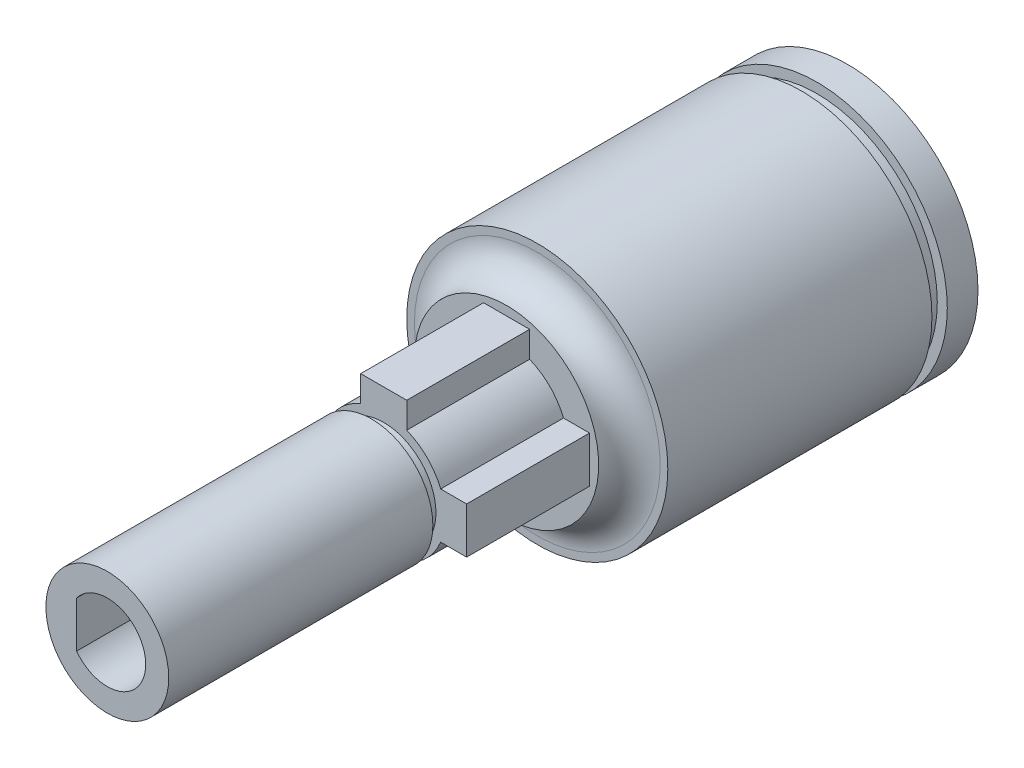
ISO-10303-21;
HEADER;
FILE_DESCRIPTION(('STEP AP214'),'2;1');
FILE_NAME('part.step','',(''),(''),'','','');
FILE_SCHEMA(('AUTOMOTIVE_DESIGN { 1 0 10303 214 1 1 1 1 }'));
ENDSEC;
DATA;
#1=APPLICATION_CONTEXT('core data for automotive mechanical design processes');
#2=APPLICATION_PROTOCOL_DEFINITION('international standard','automotive_design',2000,#1);
#3=PRODUCT_CONTEXT('',#1,'mechanical');
#4=PRODUCT('Part','Part','',(#3));
#5=PRODUCT_RELATED_PRODUCT_CATEGORY('part','',(#4));
#6=PRODUCT_DEFINITION_FORMATION('','',#4);
#7=PRODUCT_DEFINITION_CONTEXT('part definition',#1,'design');
#8=PRODUCT_DEFINITION('design','',#6,#7);
#9=PRODUCT_DEFINITION_SHAPE('','',#8);
#10=(LENGTH_UNIT() NAMED_UNIT(*) SI_UNIT(.MILLI.,.METRE.));
#11=(NAMED_UNIT(*) PLANE_ANGLE_UNIT() SI_UNIT($,.RADIAN.));
#12=(NAMED_UNIT(*) SI_UNIT($,.STERADIAN.) SOLID_ANGLE_UNIT());
#13=UNCERTAINTY_MEASURE_WITH_UNIT(LENGTH_MEASURE(1.E-05),#10,'distance_accuracy_value','');
#14=(GEOMETRIC_REPRESENTATION_CONTEXT(3) GLOBAL_UNCERTAINTY_ASSIGNED_CONTEXT((#13)) GLOBAL_UNIT_ASSIGNED_CONTEXT((#10,
#11,#12)) REPRESENTATION_CONTEXT('',''));
#15=CARTESIAN_POINT('',(0.,0.,0.));
#16=DIRECTION('',(0.,0.,1.));
#17=DIRECTION('',(1.,0.,0.));
#18=AXIS2_PLACEMENT_3D('',#15,#16,#17);
#19=CARTESIAN_POINT('',(0.,0.,-23.2));
#20=DIRECTION('',(0.,0.,1.));
#21=DIRECTION('',(1.,0.,0.));
#22=AXIS2_PLACEMENT_3D('',#19,#20,#21);
#23=CYLINDRICAL_SURFACE('',#22,8.5);
#24=CARTESIAN_POINT('',(0.,0.,-3.));
#25=DIRECTION('',(0.,0.,-1.));
#26=DIRECTION('',(-1.,0.,0.));
#27=AXIS2_PLACEMENT_3D('',#24,#25,#26);
#28=CIRCLE('',#27,8.5);
#29=CARTESIAN_POINT('',(-8.5,0.,-3.));
#30=VERTEX_POINT('',#29);
#31=EDGE_CURVE('E248',#30,#30,#28,.T.);
#32=ORIENTED_EDGE('',*,*,#31,.T.);
#33=EDGE_LOOP('',(#32));
#34=FACE_BOUND('',#33,.T.);
#35=CARTESIAN_POINT('',(0.,0.,-20.2));
#36=DIRECTION('',(0.,0.,1.));
#37=DIRECTION('',(1.,0.,0.));
#38=AXIS2_PLACEMENT_3D('',#35,#36,#37);
#39=CIRCLE('',#38,8.5);
#40=CARTESIAN_POINT('',(8.5,0.,-20.2));
#41=VERTEX_POINT('',#40);
#42=EDGE_CURVE('E237',#41,#41,#39,.T.);
#43=ORIENTED_EDGE('',*,*,#42,.T.);
#44=EDGE_LOOP('',(#43));
#45=FACE_BOUND('',#44,.T.);
#46=ADVANCED_FACE('F36',(#34,#45),#23,.T.);
#47=CARTESIAN_POINT('',(0.,0.,-1.));
#48=DIRECTION('',(0.,0.,1.));
#49=DIRECTION('',(1.,0.,0.));
#50=AXIS2_PLACEMENT_3D('',#47,#48,#49);
#51=CYLINDRICAL_SURFACE('',#50,4.);
#52=DIRECTION('',(0.,0.,1.));
#53=VECTOR('',#52,1.);
#54=CARTESIAN_POINT('',(1.5,3.70809924354783,-1.));
#55=LINE('',#54,#53);
#56=CARTESIAN_POINT('',(1.5,3.70809924354783,-1.));
#57=VERTEX_POINT('',#56);
#58=CARTESIAN_POINT('',(1.5,3.70809924354783,7.));
#59=VERTEX_POINT('',#58);
#60=EDGE_CURVE('E135',#57,#59,#55,.T.);
#61=ORIENTED_EDGE('',*,*,#60,.T.);
#62=CARTESIAN_POINT('',(0.,0.,7.));
#63=DIRECTION('',(0.,0.,-1.));
#64=DIRECTION('',(-1.,0.,0.));
#65=AXIS2_PLACEMENT_3D('',#62,#63,#64);
#66=CIRCLE('',#65,4.);
#67=CARTESIAN_POINT('',(3.70809924354784,1.49999999999999,7.));
#68=VERTEX_POINT('',#67);
#69=EDGE_CURVE('E125',#59,#68,#66,.T.);
#70=ORIENTED_EDGE('',*,*,#69,.T.);
#71=DIRECTION('',(0.,0.,1.));
#72=VECTOR('',#71,1.);
#73=CARTESIAN_POINT('',(3.70809924354784,1.49999999999999,-1.));
#74=LINE('',#73,#72);
#75=CARTESIAN_POINT('',(3.70809924354784,1.49999999999999,-1.));
#76=VERTEX_POINT('',#75);
#77=EDGE_CURVE('E151',#76,#68,#74,.T.);
#78=ORIENTED_EDGE('',*,*,#77,.F.);
#79=CARTESIAN_POINT('',(0.,0.,-1.));
#80=DIRECTION('',(0.,0.,1.));
#81=DIRECTION('',(1.,0.,0.));
#82=AXIS2_PLACEMENT_3D('',#79,#80,#81);
#83=CIRCLE('',#82,4.);
#84=EDGE_CURVE('E176',#57,#76,#83,.F.);
#85=ORIENTED_EDGE('',*,*,#84,.F.);
#86=EDGE_LOOP('',(#61,#70,#78,#85));
#87=FACE_BOUND('',#86,.T.);
#88=ADVANCED_FACE('F197',(#87),#51,.T.);
#89=DIRECTION('',(0.,0.,1.));
#90=VECTOR('',#89,1.);
#91=CARTESIAN_POINT('',(3.70809924354783,-1.50000000000001,-1.));
#92=LINE('',#91,#90);
#93=CARTESIAN_POINT('',(3.70809924354783,-1.50000000000001,-1.));
#94=VERTEX_POINT('',#93);
#95=CARTESIAN_POINT('',(3.70809924354783,-1.50000000000001,7.));
#96=VERTEX_POINT('',#95);
#97=EDGE_CURVE('E120',#94,#96,#92,.T.);
#98=ORIENTED_EDGE('',*,*,#97,.T.);
#99=CARTESIAN_POINT('',(-1.5,3.70809924354783,7.));
#100=VERTEX_POINT('',#99);
#101=EDGE_CURVE('E114',#96,#100,#66,.T.);
#102=ORIENTED_EDGE('',*,*,#101,.T.);
#103=DIRECTION('',(0.,0.,1.));
#104=VECTOR('',#103,1.);
#105=CARTESIAN_POINT('',(-1.5,3.70809924354783,-1.));
#106=LINE('',#105,#104);
#107=CARTESIAN_POINT('',(-1.5,3.70809924354783,-1.));
#108=VERTEX_POINT('',#107);
#109=EDGE_CURVE('E118',#108,#100,#106,.T.);
#110=ORIENTED_EDGE('',*,*,#109,.F.);
#111=EDGE_CURVE('E175',#94,#108,#83,.F.);
#112=ORIENTED_EDGE('',*,*,#111,.F.);
#113=EDGE_LOOP('',(#98,#102,#110,#112));
#114=FACE_BOUND('',#113,.T.);
#115=ADVANCED_FACE('F116',(#114),#51,.T.);
#116=CARTESIAN_POINT('',(-1.5,0.,-1.));
#117=DIRECTION('',(-1.,0.,0.));
#118=DIRECTION('',(0.,0.,1.));
#119=AXIS2_PLACEMENT_3D('',#116,#117,#118);
#120=PLANE('',#119);
#121=ORIENTED_EDGE('',*,*,#109,.T.);
#122=DIRECTION('',(0.,-1.,0.));
#123=VECTOR('',#122,1.);
#124=CARTESIAN_POINT('',(-1.5,0.,7.));
#125=LINE('',#124,#123);
#126=CARTESIAN_POINT('',(-1.5,5.4,7.));
#127=VERTEX_POINT('',#126);
#128=EDGE_CURVE('E133',#127,#100,#125,.T.);
#129=ORIENTED_EDGE('',*,*,#128,.F.);
#130=DIRECTION('',(0.,0.,1.));
#131=VECTOR('',#130,1.);
#132=CARTESIAN_POINT('',(-1.5,5.4,-1.));
#133=LINE('',#132,#131);
#134=CARTESIAN_POINT('',(-1.5,5.4,-1.));
#135=VERTEX_POINT('',#134);
#136=EDGE_CURVE('E161',#135,#127,#133,.T.);
#137=ORIENTED_EDGE('',*,*,#136,.F.);
#138=DIRECTION('',(0.,-1.,0.));
#139=VECTOR('',#138,1.);
#140=CARTESIAN_POINT('',(-1.5,0.,-1.));
#141=LINE('',#140,#139);
#142=EDGE_CURVE('E134',#135,#108,#141,.T.);
#143=ORIENTED_EDGE('',*,*,#142,.T.);
#144=EDGE_LOOP('',(#121,#129,#137,#143));
#145=FACE_BOUND('',#144,.T.);
#146=ADVANCED_FACE('F131',(#145),#120,.T.);
#147=CARTESIAN_POINT('',(0.,5.4,-1.));
#148=DIRECTION('',(0.,1.,0.));
#149=DIRECTION('',(0.,0.,1.));
#150=AXIS2_PLACEMENT_3D('',#147,#148,#149);
#151=PLANE('',#150);
#152=ORIENTED_EDGE('',*,*,#136,.T.);
#153=DIRECTION('',(-1.,0.,0.));
#154=VECTOR('',#153,1.);
#155=CARTESIAN_POINT('',(0.,5.4,7.));
#156=LINE('',#155,#154);
#157=CARTESIAN_POINT('',(1.5,5.4,7.));
#158=VERTEX_POINT('',#157);
#159=EDGE_CURVE('E143',#158,#127,#156,.T.);
#160=ORIENTED_EDGE('',*,*,#159,.F.);
#161=DIRECTION('',(0.,0.,1.));
#162=VECTOR('',#161,1.);
#163=CARTESIAN_POINT('',(1.5,5.4,-1.));
#164=LINE('',#163,#162);
#165=CARTESIAN_POINT('',(1.5,5.4,-1.));
#166=VERTEX_POINT('',#165);
#167=EDGE_CURVE('E164',#166,#158,#164,.T.);
#168=ORIENTED_EDGE('',*,*,#167,.F.);
#169=DIRECTION('',(-1.,0.,0.));
#170=VECTOR('',#169,1.);
#171=CARTESIAN_POINT('',(0.,5.4,-1.));
#172=LINE('',#171,#170);
#173=EDGE_CURVE('E136',#166,#135,#172,.T.);
#174=ORIENTED_EDGE('',*,*,#173,.T.);
#175=EDGE_LOOP('',(#152,#160,#168,#174));
#176=FACE_BOUND('',#175,.T.);
#177=ADVANCED_FACE('F300',(#176),#151,.T.);
#178=CARTESIAN_POINT('',(1.5,0.,-1.));
#179=DIRECTION('',(1.,0.,0.));
#180=DIRECTION('',(0.,0.,-1.));
#181=AXIS2_PLACEMENT_3D('',#178,#179,#180);
#182=PLANE('',#181);
#183=ORIENTED_EDGE('',*,*,#167,.T.);
#184=DIRECTION('',(0.,1.,0.));
#185=VECTOR('',#184,1.);
#186=CARTESIAN_POINT('',(1.5,0.,7.));
#187=LINE('',#186,#185);
#188=EDGE_CURVE('E144',#59,#158,#187,.T.);
#189=ORIENTED_EDGE('',*,*,#188,.F.);
#190=ORIENTED_EDGE('',*,*,#60,.F.);
#191=DIRECTION('',(0.,1.,0.));
#192=VECTOR('',#191,1.);
#193=CARTESIAN_POINT('',(1.5,0.,-1.));
#194=LINE('',#193,#192);
#195=EDGE_CURVE('E156',#57,#166,#194,.T.);
#196=ORIENTED_EDGE('',*,*,#195,.T.);
#197=EDGE_LOOP('',(#183,#189,#190,#196));
#198=FACE_BOUND('',#197,.T.);
#199=ADVANCED_FACE('F297',(#198),#182,.T.);
#200=CARTESIAN_POINT('',(0.,0.,7.));
#201=DIRECTION('',(0.,0.,1.));
#202=DIRECTION('',(1.,0.,0.));
#203=AXIS2_PLACEMENT_3D('',#200,#201,#202);
#204=PLANE('',#203);
#205=ORIENTED_EDGE('',*,*,#128,.T.);
#206=ORIENTED_EDGE('',*,*,#101,.F.);
#207=DIRECTION('',(1.,0.,0.));
#208=VECTOR('',#207,1.);
#209=CARTESIAN_POINT('',(0.,-1.5,7.));
#210=LINE('',#209,#208);
#211=CARTESIAN_POINT('',(5.4,-1.50000000000001,7.));
#212=VERTEX_POINT('',#211);
#213=EDGE_CURVE('E266',#96,#212,#210,.T.);
#214=ORIENTED_EDGE('',*,*,#213,.T.);
#215=DIRECTION('',(0.,1.,0.));
#216=VECTOR('',#215,1.);
#217=CARTESIAN_POINT('',(5.4,0.,7.));
#218=LINE('',#217,#216);
#219=CARTESIAN_POINT('',(5.4,1.49999999999999,7.));
#220=VERTEX_POINT('',#219);
#221=EDGE_CURVE('E268',#212,#220,#218,.T.);
#222=ORIENTED_EDGE('',*,*,#221,.T.);
#223=DIRECTION('',(-1.,0.,0.));
#224=VECTOR('',#223,1.);
#225=CARTESIAN_POINT('',(0.,1.5,7.));
#226=LINE('',#225,#224);
#227=EDGE_CURVE('E263',#220,#68,#226,.T.);
#228=ORIENTED_EDGE('',*,*,#227,.T.);
#229=ORIENTED_EDGE('',*,*,#69,.F.);
#230=ORIENTED_EDGE('',*,*,#188,.T.);
#231=ORIENTED_EDGE('',*,*,#159,.T.);
#232=EDGE_LOOP('',(#205,#206,#214,#222,#228,#229,#230,#231));
#233=FACE_BOUND('',#232,.T.);
#234=CARTESIAN_POINT('',(0.,0.,7.));
#235=DIRECTION('',(0.,0.,-1.));
#236=DIRECTION('',(-1.,0.,0.));
#237=AXIS2_PLACEMENT_3D('',#234,#235,#236);
#238=CIRCLE('',#237,3.4);
#239=CARTESIAN_POINT('',(-3.4,0.,7.));
#240=VERTEX_POINT('',#239);
#241=EDGE_CURVE('E250',#240,#240,#238,.T.);
#242=ORIENTED_EDGE('',*,*,#241,.T.);
#243=EDGE_LOOP('',(#242));
#244=FACE_BOUND('',#243,.T.);
#245=ADVANCED_FACE('F139',(#233,#244),#204,.T.);
#246=CARTESIAN_POINT('',(0.,1.5,-1.));
#247=DIRECTION('',(0.,1.,0.));
#248=DIRECTION('',(-1.,0.,0.));
#249=AXIS2_PLACEMENT_3D('',#246,#247,#248);
#250=PLANE('',#249);
#251=ORIENTED_EDGE('',*,*,#77,.T.);
#252=ORIENTED_EDGE('',*,*,#227,.F.);
#253=DIRECTION('',(0.,0.,1.));
#254=VECTOR('',#253,1.);
#255=CARTESIAN_POINT('',(5.4,1.49999999999999,-1.));
#256=LINE('',#255,#254);
#257=CARTESIAN_POINT('',(5.4,1.49999999999999,-1.));
#258=VERTEX_POINT('',#257);
#259=EDGE_CURVE('E145',#258,#220,#256,.T.);
#260=ORIENTED_EDGE('',*,*,#259,.F.);
#261=DIRECTION('',(-1.,0.,0.));
#262=VECTOR('',#261,1.);
#263=CARTESIAN_POINT('',(0.,1.5,-1.));
#264=LINE('',#263,#262);
#265=EDGE_CURVE('E271',#258,#76,#264,.T.);
#266=ORIENTED_EDGE('',*,*,#265,.T.);
#267=EDGE_LOOP('',(#251,#252,#260,#266));
#268=FACE_BOUND('',#267,.T.);
#269=ADVANCED_FACE('F284',(#268),#250,.T.);
#270=CARTESIAN_POINT('',(5.4,0.,-1.));
#271=DIRECTION('',(1.,0.,0.));
#272=DIRECTION('',(0.,1.,0.));
#273=AXIS2_PLACEMENT_3D('',#270,#271,#272);
#274=PLANE('',#273);
#275=ORIENTED_EDGE('',*,*,#259,.T.);
#276=ORIENTED_EDGE('',*,*,#221,.F.);
#277=DIRECTION('',(0.,0.,1.));
#278=VECTOR('',#277,1.);
#279=CARTESIAN_POINT('',(5.4,-1.50000000000001,-1.));
#280=LINE('',#279,#278);
#281=CARTESIAN_POINT('',(5.4,-1.50000000000001,-1.));
#282=VERTEX_POINT('',#281);
#283=EDGE_CURVE('E148',#282,#212,#280,.T.);
#284=ORIENTED_EDGE('',*,*,#283,.F.);
#285=DIRECTION('',(0.,1.,0.));
#286=VECTOR('',#285,1.);
#287=CARTESIAN_POINT('',(5.4,0.,-1.));
#288=LINE('',#287,#286);
#289=EDGE_CURVE('E277',#282,#258,#288,.T.);
#290=ORIENTED_EDGE('',*,*,#289,.T.);
#291=EDGE_LOOP('',(#275,#276,#284,#290));
#292=FACE_BOUND('',#291,.T.);
#293=ADVANCED_FACE('F291',(#292),#274,.T.);
#294=CARTESIAN_POINT('',(0.,-1.5,-1.));
#295=DIRECTION('',(0.,-1.,0.));
#296=DIRECTION('',(1.,0.,0.));
#297=AXIS2_PLACEMENT_3D('',#294,#295,#296);
#298=PLANE('',#297);
#299=ORIENTED_EDGE('',*,*,#283,.T.);
#300=ORIENTED_EDGE('',*,*,#213,.F.);
#301=ORIENTED_EDGE('',*,*,#97,.F.);
#302=DIRECTION('',(1.,0.,0.));
#303=VECTOR('',#302,1.);
#304=CARTESIAN_POINT('',(0.,-1.5,-1.));
#305=LINE('',#304,#303);
#306=EDGE_CURVE('E274',#94,#282,#305,.T.);
#307=ORIENTED_EDGE('',*,*,#306,.T.);
#308=EDGE_LOOP('',(#299,#300,#301,#307));
#309=FACE_BOUND('',#308,.T.);
#310=ADVANCED_FACE('F314',(#309),#298,.T.);
#311=CARTESIAN_POINT('',(0.,0.,-1.));
#312=DIRECTION('',(0.,0.,-1.));
#313=DIRECTION('',(-1.,0.,0.));
#314=AXIS2_PLACEMENT_3D('',#311,#312,#313);
#315=PLANE('',#314);
#316=ORIENTED_EDGE('',*,*,#142,.F.);
#317=ORIENTED_EDGE('',*,*,#173,.F.);
#318=ORIENTED_EDGE('',*,*,#195,.F.);
#319=ORIENTED_EDGE('',*,*,#84,.T.);
#320=ORIENTED_EDGE('',*,*,#265,.F.);
#321=ORIENTED_EDGE('',*,*,#289,.F.);
#322=ORIENTED_EDGE('',*,*,#306,.F.);
#323=ORIENTED_EDGE('',*,*,#111,.T.);
#324=EDGE_LOOP('',(#316,#317,#318,#319,#320,#321,#322,#323));
#325=FACE_BOUND('',#324,.T.);
#326=CARTESIAN_POINT('',(0.,0.,-1.));
#327=DIRECTION('',(0.,0.,-1.));
#328=DIRECTION('',(-1.,0.,0.));
#329=AXIS2_PLACEMENT_3D('',#326,#327,#328);
#330=CIRCLE('',#329,6.);
#331=CARTESIAN_POINT('',(-6.,0.,-1.));
#332=VERTEX_POINT('',#331);
#333=EDGE_CURVE('E259',#332,#332,#330,.T.);
#334=ORIENTED_EDGE('',*,*,#333,.F.);
#335=EDGE_LOOP('',(#334));
#336=FACE_BOUND('',#335,.T.);
#337=ADVANCED_FACE('F293',(#325,#336),#315,.F.);
#338=CARTESIAN_POINT('',(0.,4.,7.8));
#339=DIRECTION('',(0.,0.,1.));
#340=DIRECTION('',(1.,0.,0.));
#341=AXIS2_PLACEMENT_3D('',#338,#339,#340);
#342=PLANE('',#341);
#343=CARTESIAN_POINT('',(0.,0.,7.8));
#344=DIRECTION('',(0.,0.,-1.));
#345=DIRECTION('',(-1.,0.,0.));
#346=AXIS2_PLACEMENT_3D('',#343,#344,#345);
#347=CIRCLE('',#346,3.4);
#348=CARTESIAN_POINT('',(-3.4,0.,7.8));
#349=VERTEX_POINT('',#348);
#350=EDGE_CURVE('E254',#349,#349,#347,.T.);
#351=ORIENTED_EDGE('',*,*,#350,.F.);
#352=EDGE_LOOP('',(#351));
#353=FACE_BOUND('',#352,.T.);
#354=CARTESIAN_POINT('',(0.,0.,7.8));
#355=DIRECTION('',(0.,0.,-1.));
#356=DIRECTION('',(-1.,0.,0.));
#357=AXIS2_PLACEMENT_3D('',#354,#355,#356);
#358=CIRCLE('',#357,4.);
#359=CARTESIAN_POINT('',(-4.,0.,7.8));
#360=VERTEX_POINT('',#359);
#361=EDGE_CURVE('E126',#360,#360,#358,.T.);
#362=ORIENTED_EDGE('',*,*,#361,.T.);
#363=EDGE_LOOP('',(#362));
#364=FACE_BOUND('',#363,.T.);
#365=ADVANCED_FACE('F326',(#353,#364),#342,.F.);
#366=CARTESIAN_POINT('',(0.,0.,0.));
#367=DIRECTION('',(0.,0.,-1.));
#368=DIRECTION('',(-1.,0.,0.));
#369=AXIS2_PLACEMENT_3D('',#366,#367,#368);
#370=CYLINDRICAL_SURFACE('',#369,3.4);
#371=ORIENTED_EDGE('',*,*,#241,.F.);
#372=EDGE_LOOP('',(#371));
#373=FACE_BOUND('',#372,.T.);
#374=ORIENTED_EDGE('',*,*,#350,.T.);
#375=EDGE_LOOP('',(#374));
#376=FACE_BOUND('',#375,.T.);
#377=ADVANCED_FACE('F323',(#373,#376),#370,.T.);
#378=CARTESIAN_POINT('',(0.,0.,1.));
#379=DIRECTION('',(0.,0.,-1.));
#380=DIRECTION('',(-1.,0.,0.));
#381=AXIS2_PLACEMENT_3D('',#378,#379,#380);
#382=PLANE('',#381);
#383=DIRECTION('',(0.,1.,0.));
#384=VECTOR('',#383,1.);
#385=CARTESIAN_POINT('',(-2.,0.,1.));
#386=LINE('',#385,#384);
#387=CARTESIAN_POINT('',(-2.,-1.5,1.));
#388=VERTEX_POINT('',#387);
#389=CARTESIAN_POINT('',(-2.,1.5,1.));
#390=VERTEX_POINT('',#389);
#391=EDGE_CURVE('E44',#388,#390,#386,.T.);
#392=ORIENTED_EDGE('',*,*,#391,.F.);
#393=CARTESIAN_POINT('',(0.,0.,1.));
#394=DIRECTION('',(0.,0.,-1.));
#395=DIRECTION('',(-1.,0.,0.));
#396=AXIS2_PLACEMENT_3D('',#393,#394,#395);
#397=CIRCLE('',#396,2.5);
#398=EDGE_CURVE('E50',#390,#388,#397,.T.);
#399=ORIENTED_EDGE('',*,*,#398,.F.);
#400=EDGE_LOOP('',(#392,#399));
#401=FACE_BOUND('',#400,.T.);
#402=ADVANCED_FACE('F320',(#401),#382,.F.);
#403=CARTESIAN_POINT('',(-2.,0.,-1.));
#404=DIRECTION('',(1.,0.,0.));
#405=DIRECTION('',(0.,0.,-1.));
#406=AXIS2_PLACEMENT_3D('',#403,#404,#405);
#407=PLANE('',#406);
#408=DIRECTION('',(0.,0.,1.));
#409=VECTOR('',#408,1.);
#410=CARTESIAN_POINT('',(-2.,-1.5,-1.));
#411=LINE('',#410,#409);
#412=CARTESIAN_POINT('',(-2.,-1.5,25.));
#413=VERTEX_POINT('',#412);
#414=EDGE_CURVE('E178',#388,#413,#411,.T.);
#415=ORIENTED_EDGE('',*,*,#414,.F.);
#416=ORIENTED_EDGE('',*,*,#391,.T.);
#417=DIRECTION('',(0.,0.,1.));
#418=VECTOR('',#417,1.);
#419=CARTESIAN_POINT('',(-2.,1.5,-1.));
#420=LINE('',#419,#418);
#421=CARTESIAN_POINT('',(-2.,1.5,25.));
#422=VERTEX_POINT('',#421);
#423=EDGE_CURVE('E57',#390,#422,#420,.T.);
#424=ORIENTED_EDGE('',*,*,#423,.T.);
#425=DIRECTION('',(0.,1.,0.));
#426=VECTOR('',#425,1.);
#427=CARTESIAN_POINT('',(-2.,0.,25.));
#428=LINE('',#427,#426);
#429=EDGE_CURVE('E170',#413,#422,#428,.T.);
#430=ORIENTED_EDGE('',*,*,#429,.F.);
#431=EDGE_LOOP('',(#415,#416,#424,#430));
#432=FACE_BOUND('',#431,.T.);
#433=ADVANCED_FACE('F181',(#432),#407,.T.);
#434=CARTESIAN_POINT('',(0.,0.,-1.));
#435=DIRECTION('',(0.,0.,1.));
#436=DIRECTION('',(1.,0.,0.));
#437=AXIS2_PLACEMENT_3D('',#434,#435,#436);
#438=CYLINDRICAL_SURFACE('',#437,2.5);
#439=ORIENTED_EDGE('',*,*,#398,.T.);
#440=ORIENTED_EDGE('',*,*,#414,.T.);
#441=CARTESIAN_POINT('',(0.,0.,25.));
#442=DIRECTION('',(0.,0.,1.));
#443=DIRECTION('',(1.,0.,0.));
#444=AXIS2_PLACEMENT_3D('',#441,#442,#443);
#445=CIRCLE('',#444,2.5);
#446=EDGE_CURVE('E163',#413,#422,#445,.T.);
#447=ORIENTED_EDGE('',*,*,#446,.T.);
#448=ORIENTED_EDGE('',*,*,#423,.F.);
#449=EDGE_LOOP('',(#439,#440,#447,#448));
#450=FACE_BOUND('',#449,.T.);
#451=ADVANCED_FACE('F183',(#450),#438,.F.);
#452=CARTESIAN_POINT('',(0.,0.,25.));
#453=DIRECTION('',(0.,0.,1.));
#454=DIRECTION('',(1.,0.,0.));
#455=AXIS2_PLACEMENT_3D('',#452,#453,#454);
#456=PLANE('',#455);
#457=ORIENTED_EDGE('',*,*,#446,.F.);
#458=ORIENTED_EDGE('',*,*,#429,.T.);
#459=EDGE_LOOP('',(#457,#458));
#460=FACE_BOUND('',#459,.T.);
#461=CARTESIAN_POINT('',(0.,0.,25.));
#462=DIRECTION('',(0.,0.,1.));
#463=DIRECTION('',(1.,0.,0.));
#464=AXIS2_PLACEMENT_3D('',#461,#462,#463);
#465=CIRCLE('',#464,4.);
#466=CARTESIAN_POINT('',(4.,0.,25.));
#467=VERTEX_POINT('',#466);
#468=EDGE_CURVE('E172',#467,#467,#465,.F.);
#469=ORIENTED_EDGE('',*,*,#468,.F.);
#470=EDGE_LOOP('',(#469));
#471=FACE_BOUND('',#470,.T.);
#472=ADVANCED_FACE('F186',(#460,#471),#456,.T.);
#473=ORIENTED_EDGE('',*,*,#361,.F.);
#474=EDGE_LOOP('',(#473));
#475=FACE_BOUND('',#474,.T.);
#476=ORIENTED_EDGE('',*,*,#468,.T.);
#477=EDGE_LOOP('',(#476));
#478=FACE_BOUND('',#477,.T.);
#479=ADVANCED_FACE('F189',(#475,#478),#51,.T.);
#480=CARTESIAN_POINT('',(0.,0.,-3.));
#481=DIRECTION('',(0.,0.,-1.));
#482=DIRECTION('',(-1.,0.,0.));
#483=AXIS2_PLACEMENT_3D('',#480,#481,#482);
#484=PLANE('',#483);
#485=CARTESIAN_POINT('',(0.,0.,-3.));
#486=DIRECTION('',(0.,0.,-1.));
#487=DIRECTION('',(-1.,0.,0.));
#488=AXIS2_PLACEMENT_3D('',#485,#486,#487);
#489=CIRCLE('',#488,8.);
#490=CARTESIAN_POINT('',(-8.,0.,-3.));
#491=VERTEX_POINT('',#490);
#492=EDGE_CURVE('E11',#491,#491,#489,.T.);
#493=ORIENTED_EDGE('',*,*,#492,.T.);
#494=EDGE_LOOP('',(#493));
#495=FACE_BOUND('',#494,.T.);
#496=ORIENTED_EDGE('',*,*,#31,.F.);
#497=EDGE_LOOP('',(#496));
#498=FACE_BOUND('',#497,.T.);
#499=ADVANCED_FACE('F194',(#495,#498),#484,.F.);
#500=CARTESIAN_POINT('',(0.,0.,0.));
#501=DIRECTION('',(0.,0.,1.));
#502=DIRECTION('',(1.,0.,0.));
#503=AXIS2_PLACEMENT_3D('',#500,#501,#502);
#504=CYLINDRICAL_SURFACE('',#503,7.85);
#505=CARTESIAN_POINT('',(0.,0.,-21.2));
#506=DIRECTION('',(0.,0.,1.));
#507=DIRECTION('',(1.,0.,0.));
#508=AXIS2_PLACEMENT_3D('',#505,#506,#507);
#509=CIRCLE('',#508,7.85);
#510=CARTESIAN_POINT('',(7.85,0.,-21.2));
#511=VERTEX_POINT('',#510);
#512=EDGE_CURVE('E238',#511,#511,#509,.T.);
#513=ORIENTED_EDGE('',*,*,#512,.T.);
#514=EDGE_LOOP('',(#513));
#515=FACE_BOUND('',#514,.T.);
#516=CARTESIAN_POINT('',(0.,0.,-20.2));
#517=DIRECTION('',(0.,0.,1.));
#518=DIRECTION('',(1.,0.,0.));
#519=AXIS2_PLACEMENT_3D('',#516,#517,#518);
#520=CIRCLE('',#519,7.85);
#521=CARTESIAN_POINT('',(7.85,0.,-20.2));
#522=VERTEX_POINT('',#521);
#523=EDGE_CURVE('E241',#522,#522,#520,.T.);
#524=ORIENTED_EDGE('',*,*,#523,.F.);
#525=EDGE_LOOP('',(#524));
#526=FACE_BOUND('',#525,.T.);
#527=ADVANCED_FACE('F201',(#515,#526),#504,.T.);
#528=CARTESIAN_POINT('',(0.,7.85,-20.2));
#529=DIRECTION('',(0.,0.,-1.));
#530=DIRECTION('',(-1.,0.,0.));
#531=AXIS2_PLACEMENT_3D('',#528,#529,#530);
#532=PLANE('',#531);
#533=ORIENTED_EDGE('',*,*,#523,.T.);
#534=EDGE_LOOP('',(#533));
#535=FACE_BOUND('',#534,.T.);
#536=ORIENTED_EDGE('',*,*,#42,.F.);
#537=EDGE_LOOP('',(#536));
#538=FACE_BOUND('',#537,.T.);
#539=ADVANCED_FACE('F488',(#535,#538),#532,.T.);
#540=CARTESIAN_POINT('',(0.,8.5,-21.2));
#541=DIRECTION('',(0.,0.,1.));
#542=DIRECTION('',(1.,0.,0.));
#543=AXIS2_PLACEMENT_3D('',#540,#541,#542);
#544=PLANE('',#543);
#545=CARTESIAN_POINT('',(0.,0.,-21.2));
#546=DIRECTION('',(0.,0.,1.));
#547=DIRECTION('',(1.,0.,0.));
#548=AXIS2_PLACEMENT_3D('',#545,#546,#547);
#549=CIRCLE('',#548,8.5);
#550=CARTESIAN_POINT('',(8.5,0.,-21.2));
#551=VERTEX_POINT('',#550);
#552=EDGE_CURVE('E235',#551,#551,#549,.T.);
#553=ORIENTED_EDGE('',*,*,#552,.T.);
#554=EDGE_LOOP('',(#553));
#555=FACE_BOUND('',#554,.T.);
#556=ORIENTED_EDGE('',*,*,#512,.F.);
#557=EDGE_LOOP('',(#556));
#558=FACE_BOUND('',#557,.T.);
#559=ADVANCED_FACE('F226',(#555,#558),#544,.T.);
#560=CARTESIAN_POINT('',(0.,0.,-23.2));
#561=DIRECTION('',(0.,0.,-1.));
#562=DIRECTION('',(-1.,0.,0.));
#563=AXIS2_PLACEMENT_3D('',#560,#561,#562);
#564=PLANE('',#563);
#565=CARTESIAN_POINT('',(0.,0.,-23.2));
#566=DIRECTION('',(0.,0.,-1.));
#567=DIRECTION('',(-1.,0.,0.));
#568=AXIS2_PLACEMENT_3D('',#565,#566,#567);
#569=CIRCLE('',#568,8.5);
#570=CARTESIAN_POINT('',(-8.5,0.,-23.2));
#571=VERTEX_POINT('',#570);
#572=EDGE_CURVE('E232',#571,#571,#569,.T.);
#573=ORIENTED_EDGE('',*,*,#572,.T.);
#574=EDGE_LOOP('',(#573));
#575=FACE_BOUND('',#574,.T.);
#576=ADVANCED_FACE('F219',(#575),#564,.T.);
#577=ORIENTED_EDGE('',*,*,#572,.F.);
#578=EDGE_LOOP('',(#577));
#579=FACE_BOUND('',#578,.T.);
#580=ORIENTED_EDGE('',*,*,#552,.F.);
#581=EDGE_LOOP('',(#580));
#582=FACE_BOUND('',#581,.T.);
#583=ADVANCED_FACE('F212',(#579,#582),#23,.T.);
#584=CARTESIAN_POINT('',(0.,0.,-1.));
#585=DIRECTION('',(0.,0.,-1.));
#586=DIRECTION('',(-1.,0.,0.));
#587=AXIS2_PLACEMENT_3D('',#584,#585,#586);
#588=TOROIDAL_SURFACE('',#587,8.,2.);
#589=ORIENTED_EDGE('',*,*,#333,.T.);
#590=EDGE_LOOP('',(#589));
#591=FACE_BOUND('',#590,.T.);
#592=ORIENTED_EDGE('',*,*,#492,.F.);
#593=EDGE_LOOP('',(#592));
#594=FACE_BOUND('',#593,.T.);
#595=ADVANCED_FACE('F38',(#591,#594),#588,.F.);
#596=CLOSED_SHELL('',(#46,#88,#115,#146,#177,#199,#245,#269,#293,#310,#337,#365,#377,#402,#433,
#451,#472,#479,#499,#527,#539,#559,#576,#583,#595));
#597=MANIFOLD_SOLID_BREP('B2',#596);
#598=ADVANCED_BREP_SHAPE_REPRESENTATION('',(#18,#597),#14);
#599=SHAPE_DEFINITION_REPRESENTATION(#9,#598);
ENDSEC;
END-ISO-10303-21;
